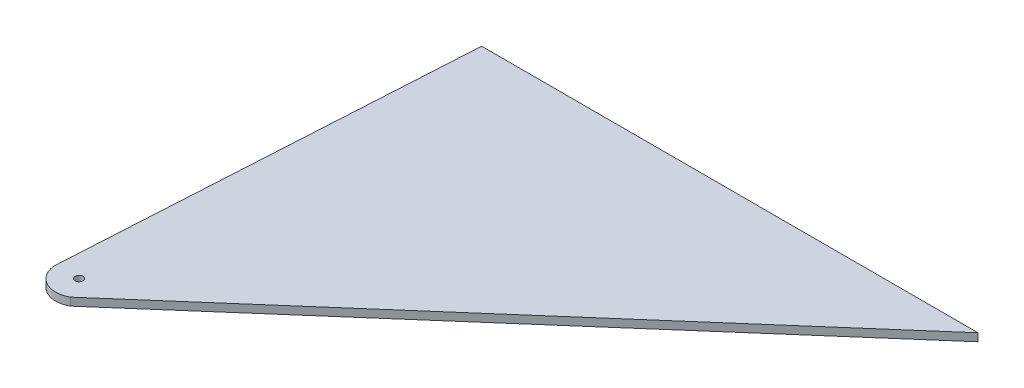
ISO-10303-21;
HEADER;
FILE_DESCRIPTION(('STEP AP214'),'2;1');
FILE_NAME('part.step','',(''),(''),'','','');
FILE_SCHEMA(('AUTOMOTIVE_DESIGN { 1 0 10303 214 1 1 1 1 }'));
ENDSEC;
DATA;
#1=APPLICATION_CONTEXT('core data for automotive mechanical design processes');
#2=APPLICATION_PROTOCOL_DEFINITION('international standard','automotive_design',2000,#1);
#3=PRODUCT_CONTEXT('',#1,'mechanical');
#4=PRODUCT('Part','Part','',(#3));
#5=PRODUCT_RELATED_PRODUCT_CATEGORY('part','',(#4));
#6=PRODUCT_DEFINITION_FORMATION('','',#4);
#7=PRODUCT_DEFINITION_CONTEXT('part definition',#1,'design');
#8=PRODUCT_DEFINITION('design','',#6,#7);
#9=PRODUCT_DEFINITION_SHAPE('','',#8);
#10=(LENGTH_UNIT() NAMED_UNIT(*) SI_UNIT(.MILLI.,.METRE.));
#11=(NAMED_UNIT(*) PLANE_ANGLE_UNIT() SI_UNIT($,.RADIAN.));
#12=(NAMED_UNIT(*) SI_UNIT($,.STERADIAN.) SOLID_ANGLE_UNIT());
#13=UNCERTAINTY_MEASURE_WITH_UNIT(LENGTH_MEASURE(1.E-05),#10,'distance_accuracy_value','');
#14=(GEOMETRIC_REPRESENTATION_CONTEXT(3) GLOBAL_UNCERTAINTY_ASSIGNED_CONTEXT((#13)) GLOBAL_UNIT_ASSIGNED_CONTEXT((#10,
#11,#12)) REPRESENTATION_CONTEXT('',''));
#15=CARTESIAN_POINT('',(0.,0.,0.));
#16=DIRECTION('',(0.,0.,1.));
#17=DIRECTION('',(1.,0.,0.));
#18=AXIS2_PLACEMENT_3D('',#15,#16,#17);
#19=CARTESIAN_POINT('',(0.,2.,0.));
#20=DIRECTION('',(0.,-1.,0.));
#21=DIRECTION('',(0.,0.,-1.));
#22=AXIS2_PLACEMENT_3D('',#19,#20,#21);
#23=PLANE('',#22);
#24=DIRECTION('',(-0.0581538427127905,0.,0.998307633236237));
#25=VECTOR('',#24,1.);
#26=CARTESIAN_POINT('',(0.,2.,-103.));
#27=LINE('',#26,#25);
#28=CARTESIAN_POINT('',(0.,2.,-103.));
#29=VERTEX_POINT('',#28);
#30=CARTESIAN_POINT('',(-6.,2.,0.));
#31=VERTEX_POINT('',#30);
#32=EDGE_CURVE('E89',#29,#31,#27,.T.);
#33=ORIENTED_EDGE('',*,*,#32,.T.);
#34=CARTESIAN_POINT('',(0.,2.,0.));
#35=DIRECTION('',(0.,1.,0.));
#36=DIRECTION('',(0.,0.,-1.));
#37=AXIS2_PLACEMENT_3D('',#34,#35,#36);
#38=CIRCLE('',#37,6.);
#39=CARTESIAN_POINT('',(3.00000000000023,2.,5.1961524227065));
#40=VERTEX_POINT('',#39);
#41=EDGE_CURVE('E84',#31,#40,#38,.T.);
#42=ORIENTED_EDGE('',*,*,#41,.T.);
#43=DIRECTION('',(0.753490969523725,0.,-0.657458256352597));
#44=VECTOR('',#43,1.);
#45=CARTESIAN_POINT('',(127.,2.,-103.));
#46=LINE('',#45,#44);
#47=CARTESIAN_POINT('',(127.,2.,-103.));
#48=VERTEX_POINT('',#47);
#49=EDGE_CURVE('E87',#40,#48,#46,.T.);
#50=ORIENTED_EDGE('',*,*,#49,.T.);
#51=DIRECTION('',(-1.,0.,0.));
#52=VECTOR('',#51,1.);
#53=CARTESIAN_POINT('',(0.,2.,-103.));
#54=LINE('',#53,#52);
#55=EDGE_CURVE('E54',#48,#29,#54,.T.);
#56=ORIENTED_EDGE('',*,*,#55,.T.);
#57=EDGE_LOOP('',(#33,#42,#50,#56));
#58=FACE_BOUND('',#57,.T.);
#59=CARTESIAN_POINT('',(0.,2.,0.));
#60=DIRECTION('',(0.,1.,0.));
#61=DIRECTION('',(0.,0.,1.));
#62=AXIS2_PLACEMENT_3D('',#59,#60,#61);
#63=CIRCLE('',#62,1.);
#64=CARTESIAN_POINT('',(0.,2.,1.));
#65=VERTEX_POINT('',#64);
#66=EDGE_CURVE('E104',#65,#65,#63,.T.);
#67=ORIENTED_EDGE('',*,*,#66,.F.);
#68=EDGE_LOOP('',(#67));
#69=FACE_BOUND('',#68,.T.);
#70=ADVANCED_FACE('F37',(#58,#69),#23,.F.);
#71=CARTESIAN_POINT('',(0.,0.,0.));
#72=DIRECTION('',(0.,-1.,0.));
#73=DIRECTION('',(0.,0.,-1.));
#74=AXIS2_PLACEMENT_3D('',#71,#72,#73);
#75=PLANE('',#74);
#76=DIRECTION('',(-0.0581538427127905,0.,0.998307633236237));
#77=VECTOR('',#76,1.);
#78=CARTESIAN_POINT('',(0.,0.,-103.));
#79=LINE('',#78,#77);
#80=CARTESIAN_POINT('',(0.,0.,-103.));
#81=VERTEX_POINT('',#80);
#82=CARTESIAN_POINT('',(-6.,0.,0.));
#83=VERTEX_POINT('',#82);
#84=EDGE_CURVE('E101',#81,#83,#79,.T.);
#85=ORIENTED_EDGE('',*,*,#84,.F.);
#86=DIRECTION('',(-1.,0.,0.));
#87=VECTOR('',#86,1.);
#88=CARTESIAN_POINT('',(0.,0.,-103.));
#89=LINE('',#88,#87);
#90=CARTESIAN_POINT('',(127.,0.,-103.));
#91=VERTEX_POINT('',#90);
#92=EDGE_CURVE('E77',#91,#81,#89,.T.);
#93=ORIENTED_EDGE('',*,*,#92,.F.);
#94=DIRECTION('',(0.753490969523725,0.,-0.657458256352597));
#95=VECTOR('',#94,1.);
#96=CARTESIAN_POINT('',(127.,0.,-103.));
#97=LINE('',#96,#95);
#98=CARTESIAN_POINT('',(3.00000000000023,0.,5.1961524227065));
#99=VERTEX_POINT('',#98);
#100=EDGE_CURVE('E71',#99,#91,#97,.T.);
#101=ORIENTED_EDGE('',*,*,#100,.F.);
#102=CARTESIAN_POINT('',(0.,0.,0.));
#103=DIRECTION('',(0.,1.,0.));
#104=DIRECTION('',(0.,0.,-1.));
#105=AXIS2_PLACEMENT_3D('',#102,#103,#104);
#106=CIRCLE('',#105,6.);
#107=EDGE_CURVE('E93',#83,#99,#106,.T.);
#108=ORIENTED_EDGE('',*,*,#107,.F.);
#109=EDGE_LOOP('',(#85,#93,#101,#108));
#110=FACE_BOUND('',#109,.T.);
#111=CARTESIAN_POINT('',(0.,0.,0.));
#112=DIRECTION('',(0.,1.,0.));
#113=DIRECTION('',(0.,0.,1.));
#114=AXIS2_PLACEMENT_3D('',#111,#112,#113);
#115=CIRCLE('',#114,1.);
#116=CARTESIAN_POINT('',(0.,0.,1.));
#117=VERTEX_POINT('',#116);
#118=EDGE_CURVE('E116',#117,#117,#115,.T.);
#119=ORIENTED_EDGE('',*,*,#118,.T.);
#120=EDGE_LOOP('',(#119));
#121=FACE_BOUND('',#120,.T.);
#122=ADVANCED_FACE('F112',(#110,#121),#75,.T.);
#123=CARTESIAN_POINT('',(0.,2.,-103.));
#124=DIRECTION('',(0.998307633236237,0.,0.0581538427127905));
#125=DIRECTION('',(0.0581538427127905,0.,-0.998307633236237));
#126=AXIS2_PLACEMENT_3D('',#123,#124,#125);
#127=PLANE('',#126);
#128=ORIENTED_EDGE('',*,*,#84,.T.);
#129=DIRECTION('',(0.,-1.,0.));
#130=VECTOR('',#129,1.);
#131=CARTESIAN_POINT('',(-6.,2.,0.));
#132=LINE('',#131,#130);
#133=EDGE_CURVE('E11',#31,#83,#132,.T.);
#134=ORIENTED_EDGE('',*,*,#133,.F.);
#135=ORIENTED_EDGE('',*,*,#32,.F.);
#136=DIRECTION('',(0.,-1.,0.));
#137=VECTOR('',#136,1.);
#138=CARTESIAN_POINT('',(0.,2.,-103.));
#139=LINE('',#138,#137);
#140=EDGE_CURVE('E97',#29,#81,#139,.T.);
#141=ORIENTED_EDGE('',*,*,#140,.T.);
#142=EDGE_LOOP('',(#128,#134,#135,#141));
#143=FACE_BOUND('',#142,.T.);
#144=ADVANCED_FACE('F39',(#143),#127,.F.);
#145=CARTESIAN_POINT('',(0.,2.,0.));
#146=DIRECTION('',(0.,-1.,0.));
#147=DIRECTION('',(0.,0.,-1.));
#148=AXIS2_PLACEMENT_3D('',#145,#146,#147);
#149=CYLINDRICAL_SURFACE('',#148,6.);
#150=ORIENTED_EDGE('',*,*,#107,.T.);
#151=DIRECTION('',(0.,-1.,0.));
#152=VECTOR('',#151,1.);
#153=CARTESIAN_POINT('',(3.00000000000023,2.,5.1961524227065));
#154=LINE('',#153,#152);
#155=EDGE_CURVE('E46',#40,#99,#154,.T.);
#156=ORIENTED_EDGE('',*,*,#155,.F.);
#157=ORIENTED_EDGE('',*,*,#41,.F.);
#158=ORIENTED_EDGE('',*,*,#133,.T.);
#159=EDGE_LOOP('',(#150,#156,#157,#158));
#160=FACE_BOUND('',#159,.T.);
#161=ADVANCED_FACE('F92',(#160),#149,.T.);
#162=CARTESIAN_POINT('',(127.,2.,-103.));
#163=DIRECTION('',(-0.657458256352597,0.,-0.753490969523725));
#164=DIRECTION('',(-0.753490969523725,0.,0.657458256352597));
#165=AXIS2_PLACEMENT_3D('',#162,#163,#164);
#166=PLANE('',#165);
#167=ORIENTED_EDGE('',*,*,#100,.T.);
#168=DIRECTION('',(0.,-1.,0.));
#169=VECTOR('',#168,1.);
#170=CARTESIAN_POINT('',(127.,2.,-103.));
#171=LINE('',#170,#169);
#172=EDGE_CURVE('E94',#48,#91,#171,.T.);
#173=ORIENTED_EDGE('',*,*,#172,.F.);
#174=ORIENTED_EDGE('',*,*,#49,.F.);
#175=ORIENTED_EDGE('',*,*,#155,.T.);
#176=EDGE_LOOP('',(#167,#173,#174,#175));
#177=FACE_BOUND('',#176,.T.);
#178=ADVANCED_FACE('F95',(#177),#166,.F.);
#179=CARTESIAN_POINT('',(0.,2.,-103.));
#180=DIRECTION('',(0.,0.,1.));
#181=DIRECTION('',(1.,0.,0.));
#182=AXIS2_PLACEMENT_3D('',#179,#180,#181);
#183=PLANE('',#182);
#184=ORIENTED_EDGE('',*,*,#92,.T.);
#185=ORIENTED_EDGE('',*,*,#140,.F.);
#186=ORIENTED_EDGE('',*,*,#55,.F.);
#187=ORIENTED_EDGE('',*,*,#172,.T.);
#188=EDGE_LOOP('',(#184,#185,#186,#187));
#189=FACE_BOUND('',#188,.T.);
#190=ADVANCED_FACE('F109',(#189),#183,.F.);
#191=CARTESIAN_POINT('',(0.,2.,0.));
#192=DIRECTION('',(0.,-1.,0.));
#193=DIRECTION('',(0.,0.,-1.));
#194=AXIS2_PLACEMENT_3D('',#191,#192,#193);
#195=CYLINDRICAL_SURFACE('',#194,1.);
#196=ORIENTED_EDGE('',*,*,#66,.T.);
#197=EDGE_LOOP('',(#196));
#198=FACE_BOUND('',#197,.T.);
#199=ORIENTED_EDGE('',*,*,#118,.F.);
#200=EDGE_LOOP('',(#199));
#201=FACE_BOUND('',#200,.T.);
#202=ADVANCED_FACE('F122',(#198,#201),#195,.F.);
#203=CLOSED_SHELL('',(#70,#122,#144,#161,#178,#190,#202));
#204=MANIFOLD_SOLID_BREP('B2',#203);
#205=ADVANCED_BREP_SHAPE_REPRESENTATION('',(#18,#204),#14);
#206=SHAPE_DEFINITION_REPRESENTATION(#9,#205);
ENDSEC;
END-ISO-10303-21;
